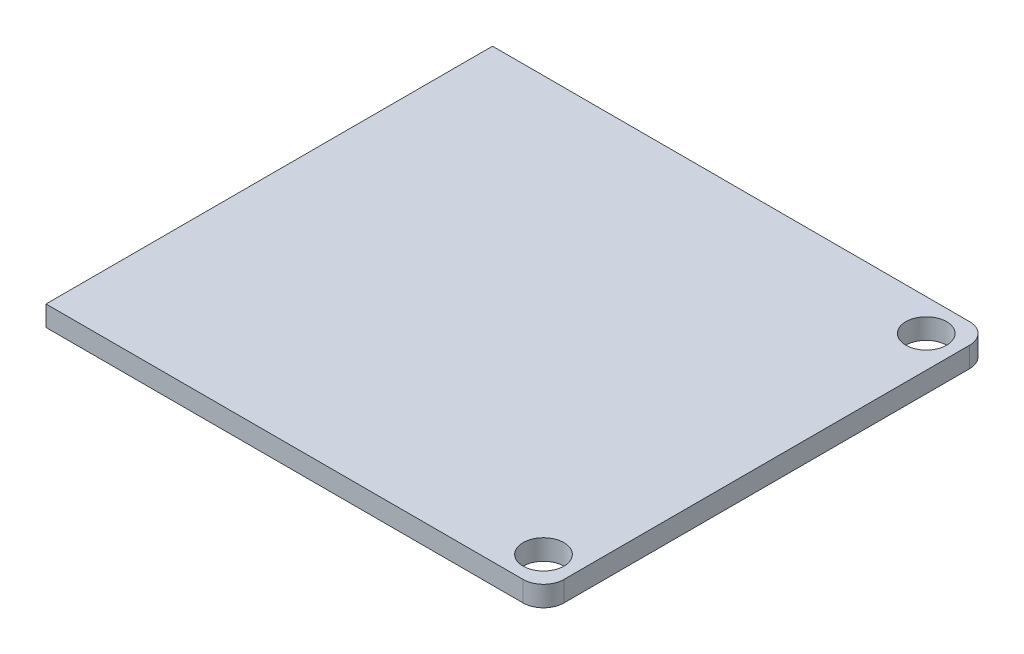
ISO-10303-21;
HEADER;
FILE_DESCRIPTION(('STEP AP214'),'2;1');
FILE_NAME('part.step','',(''),(''),'','','');
FILE_SCHEMA(('AUTOMOTIVE_DESIGN { 1 0 10303 214 1 1 1 1 }'));
ENDSEC;
DATA;
#1=APPLICATION_CONTEXT('core data for automotive mechanical design processes');
#2=APPLICATION_PROTOCOL_DEFINITION('international standard','automotive_design',2000,#1);
#3=PRODUCT_CONTEXT('',#1,'mechanical');
#4=PRODUCT('Part','Part','',(#3));
#5=PRODUCT_RELATED_PRODUCT_CATEGORY('part','',(#4));
#6=PRODUCT_DEFINITION_FORMATION('','',#4);
#7=PRODUCT_DEFINITION_CONTEXT('part definition',#1,'design');
#8=PRODUCT_DEFINITION('design','',#6,#7);
#9=PRODUCT_DEFINITION_SHAPE('','',#8);
#10=(LENGTH_UNIT() NAMED_UNIT(*) SI_UNIT(.MILLI.,.METRE.));
#11=(NAMED_UNIT(*) PLANE_ANGLE_UNIT() SI_UNIT($,.RADIAN.));
#12=(NAMED_UNIT(*) SI_UNIT($,.STERADIAN.) SOLID_ANGLE_UNIT());
#13=UNCERTAINTY_MEASURE_WITH_UNIT(LENGTH_MEASURE(1.E-05),#10,'distance_accuracy_value','');
#14=(GEOMETRIC_REPRESENTATION_CONTEXT(3) GLOBAL_UNCERTAINTY_ASSIGNED_CONTEXT((#13)) GLOBAL_UNIT_ASSIGNED_CONTEXT((#10,
#11,#12)) REPRESENTATION_CONTEXT('',''));
#15=CARTESIAN_POINT('',(0.,0.,0.));
#16=DIRECTION('',(0.,0.,1.));
#17=DIRECTION('',(1.,0.,0.));
#18=AXIS2_PLACEMENT_3D('',#15,#16,#17);
#19=CARTESIAN_POINT('',(19.5,1.6,17.5));
#20=DIRECTION('',(-1.,0.,0.));
#21=DIRECTION('',(0.,0.,1.));
#22=AXIS2_PLACEMENT_3D('',#19,#20,#21);
#23=PLANE('',#22);
#24=DIRECTION('',(0.,0.,-1.));
#25=VECTOR('',#24,1.);
#26=CARTESIAN_POINT('',(19.5,1.6,17.5));
#27=LINE('',#26,#25);
#28=CARTESIAN_POINT('',(19.5,1.6,15.9));
#29=VERTEX_POINT('',#28);
#30=CARTESIAN_POINT('',(19.5,1.6,-15.9));
#31=VERTEX_POINT('',#30);
#32=EDGE_CURVE('E96',#29,#31,#27,.T.);
#33=ORIENTED_EDGE('',*,*,#32,.F.);
#34=DIRECTION('',(0.,-1.,0.));
#35=VECTOR('',#34,1.);
#36=CARTESIAN_POINT('',(19.5,1.6,15.9));
#37=LINE('',#36,#35);
#38=CARTESIAN_POINT('',(19.5,0.,15.9));
#39=VERTEX_POINT('',#38);
#40=EDGE_CURVE('E126',#29,#39,#37,.T.);
#41=ORIENTED_EDGE('',*,*,#40,.T.);
#42=DIRECTION('',(0.,0.,-1.));
#43=VECTOR('',#42,1.);
#44=CARTESIAN_POINT('',(19.5,0.,17.5));
#45=LINE('',#44,#43);
#46=CARTESIAN_POINT('',(19.5,0.,-15.9));
#47=VERTEX_POINT('',#46);
#48=EDGE_CURVE('E115',#39,#47,#45,.T.);
#49=ORIENTED_EDGE('',*,*,#48,.T.);
#50=DIRECTION('',(0.,-1.,0.));
#51=VECTOR('',#50,1.);
#52=CARTESIAN_POINT('',(19.5,1.6,-15.9));
#53=LINE('',#52,#51);
#54=EDGE_CURVE('E105',#47,#31,#53,.F.);
#55=ORIENTED_EDGE('',*,*,#54,.T.);
#56=EDGE_LOOP('',(#33,#41,#49,#55));
#57=FACE_BOUND('',#56,.T.);
#58=ADVANCED_FACE('F35',(#57),#23,.F.);
#59=CARTESIAN_POINT('',(-19.5,1.6,-17.5));
#60=DIRECTION('',(0.,0.,1.));
#61=DIRECTION('',(1.,0.,0.));
#62=AXIS2_PLACEMENT_3D('',#59,#60,#61);
#63=PLANE('',#62);
#64=DIRECTION('',(-1.,0.,0.));
#65=VECTOR('',#64,1.);
#66=CARTESIAN_POINT('',(-19.5,1.6,-17.5));
#67=LINE('',#66,#65);
#68=CARTESIAN_POINT('',(17.9,1.6,-17.5));
#69=VERTEX_POINT('',#68);
#70=CARTESIAN_POINT('',(-19.5,1.6,-17.5));
#71=VERTEX_POINT('',#70);
#72=EDGE_CURVE('E88',#69,#71,#67,.T.);
#73=ORIENTED_EDGE('',*,*,#72,.F.);
#74=DIRECTION('',(0.,-1.,0.));
#75=VECTOR('',#74,1.);
#76=CARTESIAN_POINT('',(17.9,1.6,-17.5));
#77=LINE('',#76,#75);
#78=CARTESIAN_POINT('',(17.9,0.,-17.5));
#79=VERTEX_POINT('',#78);
#80=EDGE_CURVE('E11',#69,#79,#77,.T.);
#81=ORIENTED_EDGE('',*,*,#80,.T.);
#82=DIRECTION('',(-1.,0.,0.));
#83=VECTOR('',#82,1.);
#84=CARTESIAN_POINT('',(-19.5,0.,-17.5));
#85=LINE('',#84,#83);
#86=CARTESIAN_POINT('',(-19.5,0.,-17.5));
#87=VERTEX_POINT('',#86);
#88=EDGE_CURVE('E102',#79,#87,#85,.T.);
#89=ORIENTED_EDGE('',*,*,#88,.T.);
#90=DIRECTION('',(0.,-1.,0.));
#91=VECTOR('',#90,1.);
#92=CARTESIAN_POINT('',(-19.5,1.6,-17.5));
#93=LINE('',#92,#91);
#94=EDGE_CURVE('E99',#71,#87,#93,.T.);
#95=ORIENTED_EDGE('',*,*,#94,.F.);
#96=EDGE_LOOP('',(#73,#81,#89,#95));
#97=FACE_BOUND('',#96,.T.);
#98=ADVANCED_FACE('F100',(#97),#63,.F.);
#99=CARTESIAN_POINT('',(-19.5,1.6,17.5));
#100=DIRECTION('',(1.,0.,0.));
#101=DIRECTION('',(0.,0.,-1.));
#102=AXIS2_PLACEMENT_3D('',#99,#100,#101);
#103=PLANE('',#102);
#104=DIRECTION('',(0.,0.,1.));
#105=VECTOR('',#104,1.);
#106=CARTESIAN_POINT('',(-19.5,0.,17.5));
#107=LINE('',#106,#105);
#108=CARTESIAN_POINT('',(-19.5,0.,17.5));
#109=VERTEX_POINT('',#108);
#110=EDGE_CURVE('E120',#87,#109,#107,.T.);
#111=ORIENTED_EDGE('',*,*,#110,.T.);
#112=DIRECTION('',(0.,-1.,0.));
#113=VECTOR('',#112,1.);
#114=CARTESIAN_POINT('',(-19.5,1.6,17.5));
#115=LINE('',#114,#113);
#116=CARTESIAN_POINT('',(-19.5,1.6,17.5));
#117=VERTEX_POINT('',#116);
#118=EDGE_CURVE('E106',#117,#109,#115,.T.);
#119=ORIENTED_EDGE('',*,*,#118,.F.);
#120=DIRECTION('',(0.,0.,1.));
#121=VECTOR('',#120,1.);
#122=CARTESIAN_POINT('',(-19.5,1.6,17.5));
#123=LINE('',#122,#121);
#124=EDGE_CURVE('E92',#71,#117,#123,.T.);
#125=ORIENTED_EDGE('',*,*,#124,.F.);
#126=ORIENTED_EDGE('',*,*,#94,.T.);
#127=EDGE_LOOP('',(#111,#119,#125,#126));
#128=FACE_BOUND('',#127,.T.);
#129=ADVANCED_FACE('F108',(#128),#103,.F.);
#130=CARTESIAN_POINT('',(-19.5,1.6,17.5));
#131=DIRECTION('',(0.,0.,-1.));
#132=DIRECTION('',(-1.,0.,0.));
#133=AXIS2_PLACEMENT_3D('',#130,#131,#132);
#134=PLANE('',#133);
#135=DIRECTION('',(1.,0.,0.));
#136=VECTOR('',#135,1.);
#137=CARTESIAN_POINT('',(-19.5,0.,17.5));
#138=LINE('',#137,#136);
#139=CARTESIAN_POINT('',(17.9,0.,17.5));
#140=VERTEX_POINT('',#139);
#141=EDGE_CURVE('E122',#109,#140,#138,.T.);
#142=ORIENTED_EDGE('',*,*,#141,.T.);
#143=DIRECTION('',(0.,-1.,0.));
#144=VECTOR('',#143,1.);
#145=CARTESIAN_POINT('',(17.9,1.6,17.5));
#146=LINE('',#145,#144);
#147=CARTESIAN_POINT('',(17.9,1.6,17.5));
#148=VERTEX_POINT('',#147);
#149=EDGE_CURVE('E58',#140,#148,#146,.F.);
#150=ORIENTED_EDGE('',*,*,#149,.T.);
#151=DIRECTION('',(1.,0.,0.));
#152=VECTOR('',#151,1.);
#153=CARTESIAN_POINT('',(-19.5,1.6,17.5));
#154=LINE('',#153,#152);
#155=EDGE_CURVE('E110',#117,#148,#154,.T.);
#156=ORIENTED_EDGE('',*,*,#155,.F.);
#157=ORIENTED_EDGE('',*,*,#118,.T.);
#158=EDGE_LOOP('',(#142,#150,#156,#157));
#159=FACE_BOUND('',#158,.T.);
#160=ADVANCED_FACE('F145',(#159),#134,.F.);
#161=CARTESIAN_POINT('',(0.,1.6,0.));
#162=DIRECTION('',(0.,-1.,0.));
#163=DIRECTION('',(0.,0.,-1.));
#164=AXIS2_PLACEMENT_3D('',#161,#162,#163);
#165=PLANE('',#164);
#166=CARTESIAN_POINT('',(17.,1.6,-15.));
#167=DIRECTION('',(0.,1.,0.));
#168=DIRECTION('',(0.,0.,1.));
#169=AXIS2_PLACEMENT_3D('',#166,#167,#168);
#170=CIRCLE('',#169,1.6);
#171=CARTESIAN_POINT('',(17.,1.6,-13.4));
#172=VERTEX_POINT('',#171);
#173=EDGE_CURVE('E118',#172,#172,#170,.T.);
#174=ORIENTED_EDGE('',*,*,#173,.F.);
#175=EDGE_LOOP('',(#174));
#176=FACE_BOUND('',#175,.T.);
#177=CARTESIAN_POINT('',(17.,1.6,15.));
#178=DIRECTION('',(0.,1.,0.));
#179=DIRECTION('',(0.,0.,1.));
#180=AXIS2_PLACEMENT_3D('',#177,#178,#179);
#181=CIRCLE('',#180,1.6);
#182=CARTESIAN_POINT('',(17.,1.6,16.6));
#183=VERTEX_POINT('',#182);
#184=EDGE_CURVE('E189',#183,#183,#181,.T.);
#185=ORIENTED_EDGE('',*,*,#184,.F.);
#186=EDGE_LOOP('',(#185));
#187=FACE_BOUND('',#186,.T.);
#188=ORIENTED_EDGE('',*,*,#155,.T.);
#189=CARTESIAN_POINT('',(17.9,1.6,15.9));
#190=DIRECTION('',(0.,-1.,0.));
#191=DIRECTION('',(0.,0.,-1.));
#192=AXIS2_PLACEMENT_3D('',#189,#190,#191);
#193=CIRCLE('',#192,1.6);
#194=EDGE_CURVE('E43',#148,#29,#193,.F.);
#195=ORIENTED_EDGE('',*,*,#194,.T.);
#196=ORIENTED_EDGE('',*,*,#32,.T.);
#197=CARTESIAN_POINT('',(17.9,1.6,-15.9));
#198=DIRECTION('',(0.,-1.,0.));
#199=DIRECTION('',(0.,0.,-1.));
#200=AXIS2_PLACEMENT_3D('',#197,#198,#199);
#201=CIRCLE('',#200,1.6);
#202=EDGE_CURVE('E50',#31,#69,#201,.F.);
#203=ORIENTED_EDGE('',*,*,#202,.T.);
#204=ORIENTED_EDGE('',*,*,#72,.T.);
#205=ORIENTED_EDGE('',*,*,#124,.T.);
#206=EDGE_LOOP('',(#188,#195,#196,#203,#204,#205));
#207=FACE_BOUND('',#206,.T.);
#208=ADVANCED_FACE('F90',(#176,#187,#207),#165,.F.);
#209=CARTESIAN_POINT('',(0.,0.,0.));
#210=DIRECTION('',(0.,-1.,0.));
#211=DIRECTION('',(0.,0.,-1.));
#212=AXIS2_PLACEMENT_3D('',#209,#210,#211);
#213=PLANE('',#212);
#214=CARTESIAN_POINT('',(17.,0.,-15.));
#215=DIRECTION('',(0.,-1.,0.));
#216=DIRECTION('',(0.,0.,-1.));
#217=AXIS2_PLACEMENT_3D('',#214,#215,#216);
#218=CIRCLE('',#217,1.6);
#219=CARTESIAN_POINT('',(17.,0.,-16.6));
#220=VERTEX_POINT('',#219);
#221=EDGE_CURVE('E185',#220,#220,#218,.F.);
#222=ORIENTED_EDGE('',*,*,#221,.T.);
#223=EDGE_LOOP('',(#222));
#224=FACE_BOUND('',#223,.T.);
#225=CARTESIAN_POINT('',(17.,0.,15.));
#226=DIRECTION('',(0.,-1.,0.));
#227=DIRECTION('',(0.,0.,-1.));
#228=AXIS2_PLACEMENT_3D('',#225,#226,#227);
#229=CIRCLE('',#228,1.6);
#230=CARTESIAN_POINT('',(17.,0.,13.4));
#231=VERTEX_POINT('',#230);
#232=EDGE_CURVE('E188',#231,#231,#229,.F.);
#233=ORIENTED_EDGE('',*,*,#232,.T.);
#234=EDGE_LOOP('',(#233));
#235=FACE_BOUND('',#234,.T.);
#236=ORIENTED_EDGE('',*,*,#48,.F.);
#237=CARTESIAN_POINT('',(17.9,0.,15.9));
#238=DIRECTION('',(0.,-1.,0.));
#239=DIRECTION('',(0.,0.,-1.));
#240=AXIS2_PLACEMENT_3D('',#237,#238,#239);
#241=CIRCLE('',#240,1.6);
#242=EDGE_CURVE('E131',#39,#140,#241,.T.);
#243=ORIENTED_EDGE('',*,*,#242,.T.);
#244=ORIENTED_EDGE('',*,*,#141,.F.);
#245=ORIENTED_EDGE('',*,*,#110,.F.);
#246=ORIENTED_EDGE('',*,*,#88,.F.);
#247=CARTESIAN_POINT('',(17.9,0.,-15.9));
#248=DIRECTION('',(0.,-1.,0.));
#249=DIRECTION('',(0.,0.,-1.));
#250=AXIS2_PLACEMENT_3D('',#247,#248,#249);
#251=CIRCLE('',#250,1.6);
#252=EDGE_CURVE('E129',#79,#47,#251,.T.);
#253=ORIENTED_EDGE('',*,*,#252,.T.);
#254=EDGE_LOOP('',(#236,#243,#244,#245,#246,#253));
#255=FACE_BOUND('',#254,.T.);
#256=ADVANCED_FACE('F144',(#224,#235,#255),#213,.T.);
#257=CARTESIAN_POINT('',(17.,-0.000999999999999916,15.));
#258=DIRECTION('',(0.,1.,0.));
#259=DIRECTION('',(0.,0.,1.));
#260=AXIS2_PLACEMENT_3D('',#257,#258,#259);
#261=CYLINDRICAL_SURFACE('',#260,1.6);
#262=ORIENTED_EDGE('',*,*,#232,.F.);
#263=EDGE_LOOP('',(#262));
#264=FACE_BOUND('',#263,.T.);
#265=ORIENTED_EDGE('',*,*,#184,.T.);
#266=EDGE_LOOP('',(#265));
#267=FACE_BOUND('',#266,.T.);
#268=ADVANCED_FACE('F170',(#264,#267),#261,.F.);
#269=CARTESIAN_POINT('',(17.,-0.000999999999999916,-15.));
#270=DIRECTION('',(0.,1.,0.));
#271=DIRECTION('',(0.,0.,1.));
#272=AXIS2_PLACEMENT_3D('',#269,#270,#271);
#273=CYLINDRICAL_SURFACE('',#272,1.6);
#274=ORIENTED_EDGE('',*,*,#221,.F.);
#275=EDGE_LOOP('',(#274));
#276=FACE_BOUND('',#275,.T.);
#277=ORIENTED_EDGE('',*,*,#173,.T.);
#278=EDGE_LOOP('',(#277));
#279=FACE_BOUND('',#278,.T.);
#280=ADVANCED_FACE('F164',(#276,#279),#273,.F.);
#281=CARTESIAN_POINT('',(17.9,1.6,15.9));
#282=DIRECTION('',(0.,-1.,0.));
#283=DIRECTION('',(0.,0.,-1.));
#284=AXIS2_PLACEMENT_3D('',#281,#282,#283);
#285=CYLINDRICAL_SURFACE('',#284,1.6);
#286=ORIENTED_EDGE('',*,*,#194,.F.);
#287=ORIENTED_EDGE('',*,*,#149,.F.);
#288=ORIENTED_EDGE('',*,*,#242,.F.);
#289=ORIENTED_EDGE('',*,*,#40,.F.);
#290=EDGE_LOOP('',(#286,#287,#288,#289));
#291=FACE_BOUND('',#290,.T.);
#292=ADVANCED_FACE('F141',(#291),#285,.T.);
#293=CARTESIAN_POINT('',(17.9,1.6,-15.9));
#294=DIRECTION('',(0.,-1.,0.));
#295=DIRECTION('',(0.,0.,-1.));
#296=AXIS2_PLACEMENT_3D('',#293,#294,#295);
#297=CYLINDRICAL_SURFACE('',#296,1.6);
#298=ORIENTED_EDGE('',*,*,#202,.F.);
#299=ORIENTED_EDGE('',*,*,#54,.F.);
#300=ORIENTED_EDGE('',*,*,#252,.F.);
#301=ORIENTED_EDGE('',*,*,#80,.F.);
#302=EDGE_LOOP('',(#298,#299,#300,#301));
#303=FACE_BOUND('',#302,.T.);
#304=ADVANCED_FACE('F37',(#303),#297,.T.);
#305=CLOSED_SHELL('',(#58,#98,#129,#160,#208,#256,#268,#280,#292,#304));
#306=MANIFOLD_SOLID_BREP('B2',#305);
#307=ADVANCED_BREP_SHAPE_REPRESENTATION('',(#18,#306),#14);
#308=SHAPE_DEFINITION_REPRESENTATION(#9,#307);
ENDSEC;
END-ISO-10303-21;
